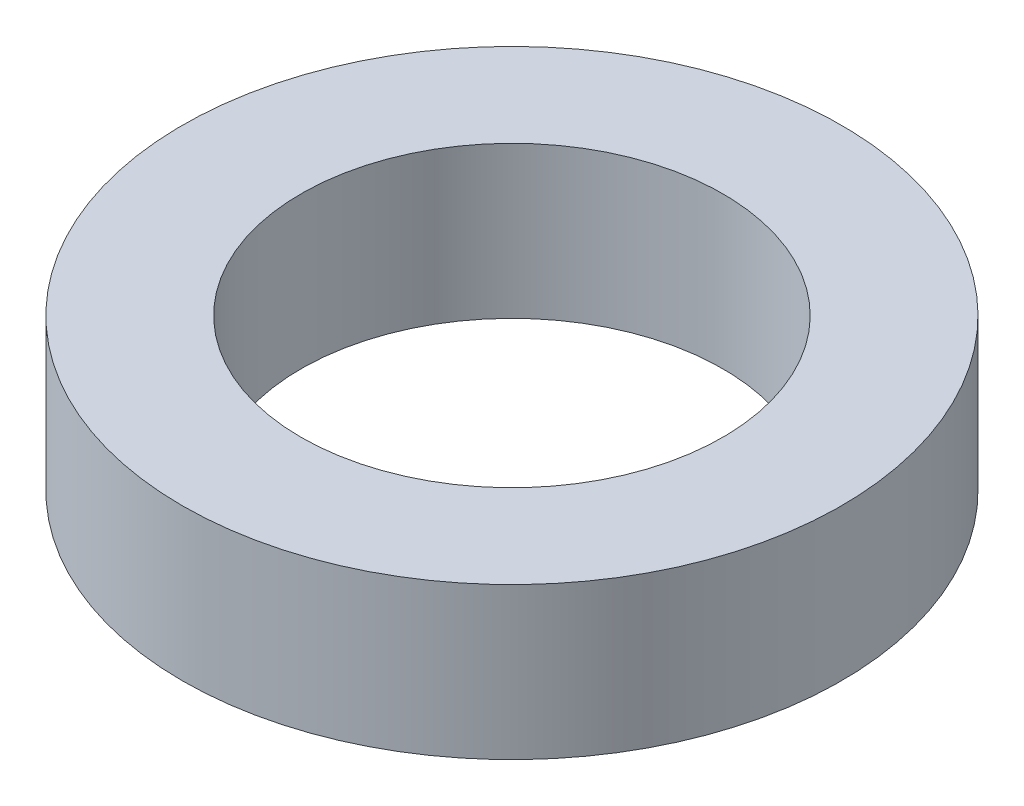
ISO-10303-21;
HEADER;
FILE_DESCRIPTION(('STEP AP214'),'2;1');
FILE_NAME('part.step','',(''),(''),'','','');
FILE_SCHEMA(('AUTOMOTIVE_DESIGN { 1 0 10303 214 1 1 1 1 }'));
ENDSEC;
DATA;
#1=APPLICATION_CONTEXT('core data for automotive mechanical design processes');
#2=APPLICATION_PROTOCOL_DEFINITION('international standard','automotive_design',2000,#1);
#3=PRODUCT_CONTEXT('',#1,'mechanical');
#4=PRODUCT('Part','Part','',(#3));
#5=PRODUCT_RELATED_PRODUCT_CATEGORY('part','',(#4));
#6=PRODUCT_DEFINITION_FORMATION('','',#4);
#7=PRODUCT_DEFINITION_CONTEXT('part definition',#1,'design');
#8=PRODUCT_DEFINITION('design','',#6,#7);
#9=PRODUCT_DEFINITION_SHAPE('','',#8);
#10=(LENGTH_UNIT() NAMED_UNIT(*) SI_UNIT(.MILLI.,.METRE.));
#11=(NAMED_UNIT(*) PLANE_ANGLE_UNIT() SI_UNIT($,.RADIAN.));
#12=(NAMED_UNIT(*) SI_UNIT($,.STERADIAN.) SOLID_ANGLE_UNIT());
#13=UNCERTAINTY_MEASURE_WITH_UNIT(LENGTH_MEASURE(1.E-05),#10,'distance_accuracy_value','');
#14=(GEOMETRIC_REPRESENTATION_CONTEXT(3) GLOBAL_UNCERTAINTY_ASSIGNED_CONTEXT((#13)) GLOBAL_UNIT_ASSIGNED_CONTEXT((#10,
#11,#12)) REPRESENTATION_CONTEXT('',''));
#15=CARTESIAN_POINT('',(0.,0.,0.));
#16=DIRECTION('',(0.,0.,1.));
#17=DIRECTION('',(1.,0.,0.));
#18=AXIS2_PLACEMENT_3D('',#15,#16,#17);
#19=CARTESIAN_POINT('',(0.,2.3,0.));
#20=DIRECTION('',(0.,1.,0.));
#21=DIRECTION('',(0.,0.,1.));
#22=AXIS2_PLACEMENT_3D('',#19,#20,#21);
#23=PLANE('',#22);
#24=CARTESIAN_POINT('',(0.,2.3,0.));
#25=DIRECTION('',(0.,1.,0.));
#26=DIRECTION('',(0.,0.,1.));
#27=AXIS2_PLACEMENT_3D('',#24,#25,#26);
#28=CIRCLE('',#27,5.);
#29=CARTESIAN_POINT('',(0.,2.3,5.));
#30=VERTEX_POINT('',#29);
#31=EDGE_CURVE('E10',#30,#30,#28,.T.);
#32=ORIENTED_EDGE('',*,*,#31,.T.);
#33=EDGE_LOOP('',(#32));
#34=FACE_BOUND('',#33,.T.);
#35=CARTESIAN_POINT('',(0.,2.3,0.));
#36=DIRECTION('',(0.,1.,0.));
#37=DIRECTION('',(0.,0.,1.));
#38=AXIS2_PLACEMENT_3D('',#35,#36,#37);
#39=CIRCLE('',#38,3.2);
#40=CARTESIAN_POINT('',(0.,2.3,3.2));
#41=VERTEX_POINT('',#40);
#42=EDGE_CURVE('E50',#41,#41,#39,.T.);
#43=ORIENTED_EDGE('',*,*,#42,.F.);
#44=EDGE_LOOP('',(#43));
#45=FACE_BOUND('',#44,.T.);
#46=ADVANCED_FACE('F37',(#34,#45),#23,.T.);
#47=CARTESIAN_POINT('',(0.,0.,0.));
#48=DIRECTION('',(0.,1.,0.));
#49=DIRECTION('',(0.,0.,1.));
#50=AXIS2_PLACEMENT_3D('',#47,#48,#49);
#51=PLANE('',#50);
#52=CARTESIAN_POINT('',(0.,0.,0.));
#53=DIRECTION('',(0.,1.,0.));
#54=DIRECTION('',(0.,0.,1.));
#55=AXIS2_PLACEMENT_3D('',#52,#53,#54);
#56=CIRCLE('',#55,5.);
#57=CARTESIAN_POINT('',(0.,0.,5.));
#58=VERTEX_POINT('',#57);
#59=EDGE_CURVE('E41',#58,#58,#56,.T.);
#60=ORIENTED_EDGE('',*,*,#59,.F.);
#61=EDGE_LOOP('',(#60));
#62=FACE_BOUND('',#61,.T.);
#63=CARTESIAN_POINT('',(0.,0.,0.));
#64=DIRECTION('',(0.,1.,0.));
#65=DIRECTION('',(0.,0.,1.));
#66=AXIS2_PLACEMENT_3D('',#63,#64,#65);
#67=CIRCLE('',#66,3.2);
#68=CARTESIAN_POINT('',(0.,0.,3.2));
#69=VERTEX_POINT('',#68);
#70=EDGE_CURVE('E52',#69,#69,#67,.T.);
#71=ORIENTED_EDGE('',*,*,#70,.T.);
#72=EDGE_LOOP('',(#71));
#73=FACE_BOUND('',#72,.T.);
#74=ADVANCED_FACE('F64',(#62,#73),#51,.F.);
#75=CARTESIAN_POINT('',(0.,2.3,0.));
#76=DIRECTION('',(0.,-1.,0.));
#77=DIRECTION('',(0.,0.,-1.));
#78=AXIS2_PLACEMENT_3D('',#75,#76,#77);
#79=CYLINDRICAL_SURFACE('',#78,5.);
#80=ORIENTED_EDGE('',*,*,#31,.F.);
#81=EDGE_LOOP('',(#80));
#82=FACE_BOUND('',#81,.T.);
#83=ORIENTED_EDGE('',*,*,#59,.T.);
#84=EDGE_LOOP('',(#83));
#85=FACE_BOUND('',#84,.T.);
#86=ADVANCED_FACE('F39',(#82,#85),#79,.T.);
#87=CARTESIAN_POINT('',(0.,2.3,0.));
#88=DIRECTION('',(0.,-1.,0.));
#89=DIRECTION('',(0.,0.,-1.));
#90=AXIS2_PLACEMENT_3D('',#87,#88,#89);
#91=CYLINDRICAL_SURFACE('',#90,3.2);
#92=ORIENTED_EDGE('',*,*,#42,.T.);
#93=EDGE_LOOP('',(#92));
#94=FACE_BOUND('',#93,.T.);
#95=ORIENTED_EDGE('',*,*,#70,.F.);
#96=EDGE_LOOP('',(#95));
#97=FACE_BOUND('',#96,.T.);
#98=ADVANCED_FACE('F60',(#94,#97),#91,.F.);
#99=CLOSED_SHELL('',(#46,#74,#86,#98));
#100=MANIFOLD_SOLID_BREP('B2',#99);
#101=ADVANCED_BREP_SHAPE_REPRESENTATION('',(#18,#100),#14);
#102=SHAPE_DEFINITION_REPRESENTATION(#9,#101);
ENDSEC;
END-ISO-10303-21;
